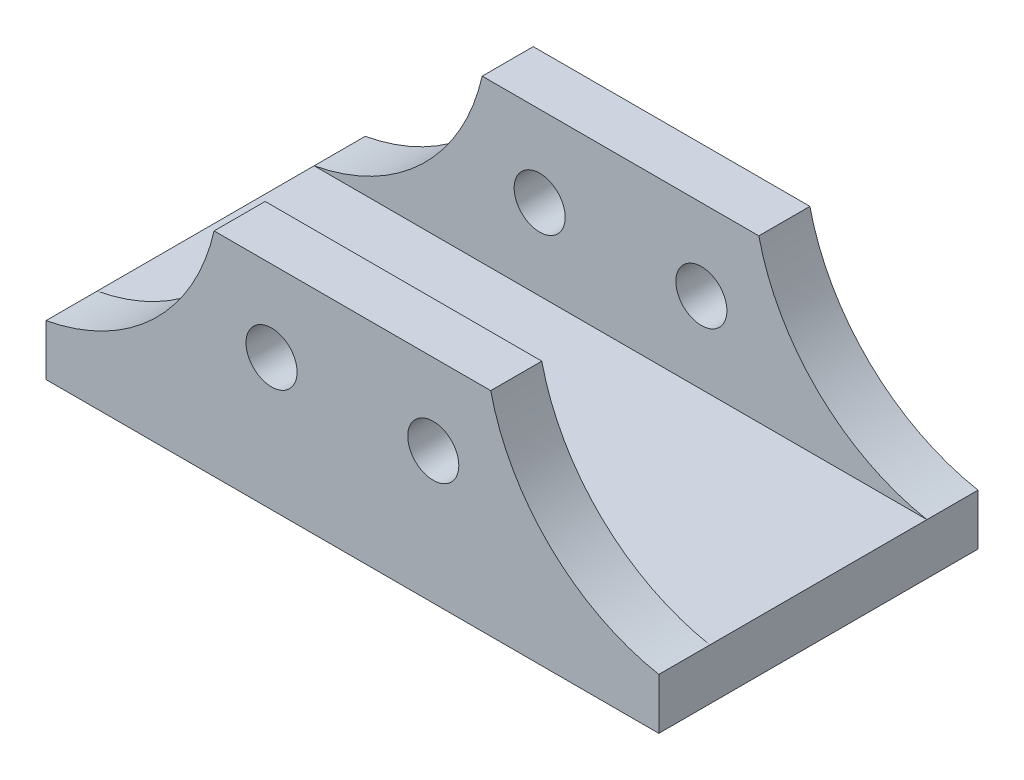
ISO-10303-21;
HEADER;
FILE_DESCRIPTION(('STEP AP214'),'2;1');
FILE_NAME('part.step','',(''),(''),'','','');
FILE_SCHEMA(('AUTOMOTIVE_DESIGN { 1 0 10303 214 1 1 1 1 }'));
ENDSEC;
DATA;
#1=APPLICATION_CONTEXT('core data for automotive mechanical design processes');
#2=APPLICATION_PROTOCOL_DEFINITION('international standard','automotive_design',2000,#1);
#3=PRODUCT_CONTEXT('',#1,'mechanical');
#4=PRODUCT('Part','Part','',(#3));
#5=PRODUCT_RELATED_PRODUCT_CATEGORY('part','',(#4));
#6=PRODUCT_DEFINITION_FORMATION('','',#4);
#7=PRODUCT_DEFINITION_CONTEXT('part definition',#1,'design');
#8=PRODUCT_DEFINITION('design','',#6,#7);
#9=PRODUCT_DEFINITION_SHAPE('','',#8);
#10=(LENGTH_UNIT() NAMED_UNIT(*) SI_UNIT(.MILLI.,.METRE.));
#11=(NAMED_UNIT(*) PLANE_ANGLE_UNIT() SI_UNIT($,.RADIAN.));
#12=(NAMED_UNIT(*) SI_UNIT($,.STERADIAN.) SOLID_ANGLE_UNIT());
#13=UNCERTAINTY_MEASURE_WITH_UNIT(LENGTH_MEASURE(1.E-05),#10,'distance_accuracy_value','');
#14=(GEOMETRIC_REPRESENTATION_CONTEXT(3) GLOBAL_UNCERTAINTY_ASSIGNED_CONTEXT((#13)) GLOBAL_UNIT_ASSIGNED_CONTEXT((#10,
#11,#12)) REPRESENTATION_CONTEXT('',''));
#15=CARTESIAN_POINT('',(0.,0.,0.));
#16=DIRECTION('',(0.,0.,1.));
#17=DIRECTION('',(1.,0.,0.));
#18=AXIS2_PLACEMENT_3D('',#15,#16,#17);
#19=CARTESIAN_POINT('',(81.2436376247931,61.1381233205086,12.));
#20=DIRECTION('',(0.,0.,1.));
#21=DIRECTION('',(1.,0.,0.));
#22=AXIS2_PLACEMENT_3D('',#19,#20,#21);
#23=PLANE('',#22);
#24=DIRECTION('',(-1.,0.,0.));
#25=VECTOR('',#24,1.);
#26=CARTESIAN_POINT('',(-72.,12.,12.));
#27=LINE('',#26,#25);
#28=CARTESIAN_POINT('',(72.,12.,12.));
#29=VERTEX_POINT('',#28);
#30=CARTESIAN_POINT('',(-72.,12.,12.));
#31=VERTEX_POINT('',#30);
#32=EDGE_CURVE('E209',#29,#31,#27,.T.);
#33=ORIENTED_EDGE('',*,*,#32,.F.);
#34=CARTESIAN_POINT('',(81.2436376247931,61.1381233205086,12.));
#35=DIRECTION('',(0.,0.,1.));
#36=DIRECTION('',(1.,0.,0.));
#37=AXIS2_PLACEMENT_3D('',#34,#35,#36);
#38=CIRCLE('',#37,50.);
#39=CARTESIAN_POINT('',(32.5,50.,12.));
#40=VERTEX_POINT('',#39);
#41=EDGE_CURVE('E231',#40,#29,#38,.T.);
#42=ORIENTED_EDGE('',*,*,#41,.F.);
#43=DIRECTION('',(1.,0.,0.));
#44=VECTOR('',#43,1.);
#45=CARTESIAN_POINT('',(-32.5,50.,12.));
#46=LINE('',#45,#44);
#47=CARTESIAN_POINT('',(-32.5,50.,12.));
#48=VERTEX_POINT('',#47);
#49=EDGE_CURVE('E229',#48,#40,#46,.T.);
#50=ORIENTED_EDGE('',*,*,#49,.F.);
#51=CARTESIAN_POINT('',(-81.2436376247931,61.1381233205086,12.));
#52=DIRECTION('',(0.,0.,-1.));
#53=DIRECTION('',(-1.,0.,0.));
#54=AXIS2_PLACEMENT_3D('',#51,#52,#53);
#55=CIRCLE('',#54,50.);
#56=EDGE_CURVE('E233',#48,#31,#55,.T.);
#57=ORIENTED_EDGE('',*,*,#56,.T.);
#58=EDGE_LOOP('',(#33,#42,#50,#57));
#59=FACE_BOUND('',#58,.T.);
#60=CARTESIAN_POINT('',(-19.,31.,12.));
#61=DIRECTION('',(0.,0.,-1.));
#62=DIRECTION('',(-1.,0.,0.));
#63=AXIS2_PLACEMENT_3D('',#60,#61,#62);
#64=CIRCLE('',#63,6.);
#65=CARTESIAN_POINT('',(-25.,31.,12.));
#66=VERTEX_POINT('',#65);
#67=EDGE_CURVE('E217',#66,#66,#64,.T.);
#68=ORIENTED_EDGE('',*,*,#67,.T.);
#69=EDGE_LOOP('',(#68));
#70=FACE_BOUND('',#69,.T.);
#71=CARTESIAN_POINT('',(19.,31.,12.));
#72=DIRECTION('',(0.,0.,1.));
#73=DIRECTION('',(1.,0.,0.));
#74=AXIS2_PLACEMENT_3D('',#71,#72,#73);
#75=CIRCLE('',#74,6.);
#76=CARTESIAN_POINT('',(25.,31.,12.));
#77=VERTEX_POINT('',#76);
#78=EDGE_CURVE('E223',#77,#77,#75,.T.);
#79=ORIENTED_EDGE('',*,*,#78,.F.);
#80=EDGE_LOOP('',(#79));
#81=FACE_BOUND('',#80,.T.);
#82=ADVANCED_FACE('F74',(#59,#70,#81),#23,.T.);
#83=CARTESIAN_POINT('',(81.2436376247931,61.1381233205086,0.));
#84=DIRECTION('',(0.,0.,1.));
#85=DIRECTION('',(1.,0.,0.));
#86=AXIS2_PLACEMENT_3D('',#83,#84,#85);
#87=PLANE('',#86);
#88=CARTESIAN_POINT('',(-19.,31.,0.));
#89=DIRECTION('',(0.,0.,-1.));
#90=DIRECTION('',(-1.,0.,0.));
#91=AXIS2_PLACEMENT_3D('',#88,#89,#90);
#92=CIRCLE('',#91,6.);
#93=CARTESIAN_POINT('',(-25.,31.,0.));
#94=VERTEX_POINT('',#93);
#95=EDGE_CURVE('E215',#94,#94,#92,.T.);
#96=ORIENTED_EDGE('',*,*,#95,.F.);
#97=EDGE_LOOP('',(#96));
#98=FACE_BOUND('',#97,.T.);
#99=DIRECTION('',(1.,0.,0.));
#100=VECTOR('',#99,1.);
#101=CARTESIAN_POINT('',(-32.5,50.,0.));
#102=LINE('',#101,#100);
#103=CARTESIAN_POINT('',(-32.5,50.,0.));
#104=VERTEX_POINT('',#103);
#105=CARTESIAN_POINT('',(32.5,50.,0.));
#106=VERTEX_POINT('',#105);
#107=EDGE_CURVE('E226',#104,#106,#102,.T.);
#108=ORIENTED_EDGE('',*,*,#107,.T.);
#109=CARTESIAN_POINT('',(81.2436376247931,61.1381233205086,0.));
#110=DIRECTION('',(0.,0.,1.));
#111=DIRECTION('',(1.,0.,0.));
#112=AXIS2_PLACEMENT_3D('',#109,#110,#111);
#113=CIRCLE('',#112,50.);
#114=CARTESIAN_POINT('',(72.,12.,0.));
#115=VERTEX_POINT('',#114);
#116=EDGE_CURVE('E238',#106,#115,#113,.T.);
#117=ORIENTED_EDGE('',*,*,#116,.T.);
#118=DIRECTION('',(0.,-1.,0.));
#119=VECTOR('',#118,1.);
#120=CARTESIAN_POINT('',(72.,12.,0.));
#121=LINE('',#120,#119);
#122=CARTESIAN_POINT('',(72.,0.,0.));
#123=VERTEX_POINT('',#122);
#124=EDGE_CURVE('E241',#115,#123,#121,.T.);
#125=ORIENTED_EDGE('',*,*,#124,.T.);
#126=DIRECTION('',(1.,0.,0.));
#127=VECTOR('',#126,1.);
#128=CARTESIAN_POINT('',(-72.,0.,0.));
#129=LINE('',#128,#127);
#130=CARTESIAN_POINT('',(-72.,0.,0.));
#131=VERTEX_POINT('',#130);
#132=EDGE_CURVE('E244',#131,#123,#129,.T.);
#133=ORIENTED_EDGE('',*,*,#132,.F.);
#134=DIRECTION('',(0.,-1.,0.));
#135=VECTOR('',#134,1.);
#136=CARTESIAN_POINT('',(-72.,12.,0.));
#137=LINE('',#136,#135);
#138=CARTESIAN_POINT('',(-72.,12.,0.));
#139=VERTEX_POINT('',#138);
#140=EDGE_CURVE('E247',#139,#131,#137,.T.);
#141=ORIENTED_EDGE('',*,*,#140,.F.);
#142=CARTESIAN_POINT('',(-81.2436376247931,61.1381233205086,0.));
#143=DIRECTION('',(0.,0.,-1.));
#144=DIRECTION('',(-1.,0.,0.));
#145=AXIS2_PLACEMENT_3D('',#142,#143,#144);
#146=CIRCLE('',#145,50.);
#147=EDGE_CURVE('E115',#104,#139,#146,.T.);
#148=ORIENTED_EDGE('',*,*,#147,.F.);
#149=EDGE_LOOP('',(#108,#117,#125,#133,#141,#148));
#150=FACE_BOUND('',#149,.T.);
#151=CARTESIAN_POINT('',(19.,31.,0.));
#152=DIRECTION('',(0.,0.,1.));
#153=DIRECTION('',(1.,0.,0.));
#154=AXIS2_PLACEMENT_3D('',#151,#152,#153);
#155=CIRCLE('',#154,6.);
#156=CARTESIAN_POINT('',(25.,31.,0.));
#157=VERTEX_POINT('',#156);
#158=EDGE_CURVE('E220',#157,#157,#155,.T.);
#159=ORIENTED_EDGE('',*,*,#158,.T.);
#160=EDGE_LOOP('',(#159));
#161=FACE_BOUND('',#160,.T.);
#162=ADVANCED_FACE('F261',(#98,#150,#161),#87,.F.);
#163=CARTESIAN_POINT('',(-32.5,50.,12.));
#164=DIRECTION('',(0.,1.,0.));
#165=DIRECTION('',(0.,0.,1.));
#166=AXIS2_PLACEMENT_3D('',#163,#164,#165);
#167=PLANE('',#166);
#168=ORIENTED_EDGE('',*,*,#107,.F.);
#169=DIRECTION('',(0.,0.,-1.));
#170=VECTOR('',#169,1.);
#171=CARTESIAN_POINT('',(-32.5,50.,12.));
#172=LINE('',#171,#170);
#173=EDGE_CURVE('E12',#48,#104,#172,.T.);
#174=ORIENTED_EDGE('',*,*,#173,.F.);
#175=ORIENTED_EDGE('',*,*,#49,.T.);
#176=DIRECTION('',(0.,0.,-1.));
#177=VECTOR('',#176,1.);
#178=CARTESIAN_POINT('',(32.5,50.,12.));
#179=LINE('',#178,#177);
#180=EDGE_CURVE('E78',#40,#106,#179,.T.);
#181=ORIENTED_EDGE('',*,*,#180,.T.);
#182=EDGE_LOOP('',(#168,#174,#175,#181));
#183=FACE_BOUND('',#182,.T.);
#184=ADVANCED_FACE('F76',(#183),#167,.T.);
#185=CARTESIAN_POINT('',(-81.2436376247931,61.1381233205086,12.));
#186=DIRECTION('',(0.,0.,-1.));
#187=DIRECTION('',(-1.,0.,0.));
#188=AXIS2_PLACEMENT_3D('',#185,#186,#187);
#189=CYLINDRICAL_SURFACE('',#188,50.);
#190=ORIENTED_EDGE('',*,*,#147,.T.);
#191=DIRECTION('',(0.,0.,-1.));
#192=VECTOR('',#191,1.);
#193=CARTESIAN_POINT('',(-72.,12.,12.));
#194=LINE('',#193,#192);
#195=EDGE_CURVE('E84',#31,#139,#194,.T.);
#196=ORIENTED_EDGE('',*,*,#195,.F.);
#197=ORIENTED_EDGE('',*,*,#56,.F.);
#198=ORIENTED_EDGE('',*,*,#173,.T.);
#199=EDGE_LOOP('',(#190,#196,#197,#198));
#200=FACE_BOUND('',#199,.T.);
#201=ADVANCED_FACE('F288',(#200),#189,.F.);
#202=CARTESIAN_POINT('',(-72.,12.,12.));
#203=DIRECTION('',(1.,0.,0.));
#204=DIRECTION('',(0.,0.,-1.));
#205=AXIS2_PLACEMENT_3D('',#202,#203,#204);
#206=PLANE('',#205);
#207=ORIENTED_EDGE('',*,*,#140,.T.);
#208=DIRECTION('',(0.,0.,-1.));
#209=VECTOR('',#208,1.);
#210=CARTESIAN_POINT('',(-72.,0.,12.));
#211=LINE('',#210,#209);
#212=CARTESIAN_POINT('',(-72.,0.,75.));
#213=VERTEX_POINT('',#212);
#214=EDGE_CURVE('E251',#213,#131,#211,.T.);
#215=ORIENTED_EDGE('',*,*,#214,.F.);
#216=DIRECTION('',(0.,-1.,0.));
#217=VECTOR('',#216,1.);
#218=CARTESIAN_POINT('',(-72.,12.,75.));
#219=LINE('',#218,#217);
#220=CARTESIAN_POINT('',(-72.,12.,75.));
#221=VERTEX_POINT('',#220);
#222=EDGE_CURVE('E183',#221,#213,#219,.T.);
#223=ORIENTED_EDGE('',*,*,#222,.F.);
#224=DIRECTION('',(0.,0.,1.));
#225=VECTOR('',#224,1.);
#226=CARTESIAN_POINT('',(-72.,12.,63.));
#227=LINE('',#226,#225);
#228=CARTESIAN_POINT('',(-72.,12.,63.));
#229=VERTEX_POINT('',#228);
#230=EDGE_CURVE('E205',#229,#221,#227,.T.);
#231=ORIENTED_EDGE('',*,*,#230,.F.);
#232=DIRECTION('',(0.,0.,1.));
#233=VECTOR('',#232,1.);
#234=CARTESIAN_POINT('',(-72.,12.,12.));
#235=LINE('',#234,#233);
#236=EDGE_CURVE('E213',#31,#229,#235,.T.);
#237=ORIENTED_EDGE('',*,*,#236,.F.);
#238=ORIENTED_EDGE('',*,*,#195,.T.);
#239=EDGE_LOOP('',(#207,#215,#223,#231,#237,#238));
#240=FACE_BOUND('',#239,.T.);
#241=ADVANCED_FACE('F266',(#240),#206,.F.);
#242=CARTESIAN_POINT('',(-72.,0.,12.));
#243=DIRECTION('',(0.,1.,0.));
#244=DIRECTION('',(0.,0.,1.));
#245=AXIS2_PLACEMENT_3D('',#242,#243,#244);
#246=PLANE('',#245);
#247=ORIENTED_EDGE('',*,*,#132,.T.);
#248=DIRECTION('',(0.,0.,-1.));
#249=VECTOR('',#248,1.);
#250=CARTESIAN_POINT('',(72.,0.,12.));
#251=LINE('',#250,#249);
#252=CARTESIAN_POINT('',(72.,0.,75.));
#253=VERTEX_POINT('',#252);
#254=EDGE_CURVE('E254',#253,#123,#251,.T.);
#255=ORIENTED_EDGE('',*,*,#254,.F.);
#256=DIRECTION('',(1.,0.,0.));
#257=VECTOR('',#256,1.);
#258=CARTESIAN_POINT('',(-72.,0.,75.));
#259=LINE('',#258,#257);
#260=EDGE_CURVE('E197',#213,#253,#259,.T.);
#261=ORIENTED_EDGE('',*,*,#260,.F.);
#262=ORIENTED_EDGE('',*,*,#214,.T.);
#263=EDGE_LOOP('',(#247,#255,#261,#262));
#264=FACE_BOUND('',#263,.T.);
#265=ADVANCED_FACE('F271',(#264),#246,.F.);
#266=CARTESIAN_POINT('',(72.,12.,12.));
#267=DIRECTION('',(1.,0.,0.));
#268=DIRECTION('',(0.,0.,-1.));
#269=AXIS2_PLACEMENT_3D('',#266,#267,#268);
#270=PLANE('',#269);
#271=ORIENTED_EDGE('',*,*,#124,.F.);
#272=DIRECTION('',(0.,0.,-1.));
#273=VECTOR('',#272,1.);
#274=CARTESIAN_POINT('',(72.,12.,12.));
#275=LINE('',#274,#273);
#276=EDGE_CURVE('E255',#29,#115,#275,.T.);
#277=ORIENTED_EDGE('',*,*,#276,.F.);
#278=DIRECTION('',(0.,0.,1.));
#279=VECTOR('',#278,1.);
#280=CARTESIAN_POINT('',(72.,12.,12.));
#281=LINE('',#280,#279);
#282=CARTESIAN_POINT('',(72.,12.,63.));
#283=VERTEX_POINT('',#282);
#284=EDGE_CURVE('E212',#29,#283,#281,.T.);
#285=ORIENTED_EDGE('',*,*,#284,.T.);
#286=DIRECTION('',(0.,0.,1.));
#287=VECTOR('',#286,1.);
#288=CARTESIAN_POINT('',(72.,12.,63.));
#289=LINE('',#288,#287);
#290=CARTESIAN_POINT('',(72.,12.,75.));
#291=VERTEX_POINT('',#290);
#292=EDGE_CURVE('E166',#283,#291,#289,.T.);
#293=ORIENTED_EDGE('',*,*,#292,.T.);
#294=DIRECTION('',(0.,-1.,0.));
#295=VECTOR('',#294,1.);
#296=CARTESIAN_POINT('',(72.,12.,75.));
#297=LINE('',#296,#295);
#298=EDGE_CURVE('E194',#291,#253,#297,.T.);
#299=ORIENTED_EDGE('',*,*,#298,.T.);
#300=ORIENTED_EDGE('',*,*,#254,.T.);
#301=EDGE_LOOP('',(#271,#277,#285,#293,#299,#300));
#302=FACE_BOUND('',#301,.T.);
#303=ADVANCED_FACE('F281',(#302),#270,.T.);
#304=CARTESIAN_POINT('',(81.2436376247931,61.1381233205086,12.));
#305=DIRECTION('',(0.,0.,-1.));
#306=DIRECTION('',(-1.,0.,0.));
#307=AXIS2_PLACEMENT_3D('',#304,#305,#306);
#308=CYLINDRICAL_SURFACE('',#307,50.);
#309=ORIENTED_EDGE('',*,*,#116,.F.);
#310=ORIENTED_EDGE('',*,*,#180,.F.);
#311=ORIENTED_EDGE('',*,*,#41,.T.);
#312=ORIENTED_EDGE('',*,*,#276,.T.);
#313=EDGE_LOOP('',(#309,#310,#311,#312));
#314=FACE_BOUND('',#313,.T.);
#315=ADVANCED_FACE('F259',(#314),#308,.F.);
#316=CARTESIAN_POINT('',(19.,31.,12.));
#317=DIRECTION('',(0.,0.,-1.));
#318=DIRECTION('',(-1.,0.,0.));
#319=AXIS2_PLACEMENT_3D('',#316,#317,#318);
#320=CYLINDRICAL_SURFACE('',#319,6.);
#321=ORIENTED_EDGE('',*,*,#78,.T.);
#322=EDGE_LOOP('',(#321));
#323=FACE_BOUND('',#322,.T.);
#324=ORIENTED_EDGE('',*,*,#158,.F.);
#325=EDGE_LOOP('',(#324));
#326=FACE_BOUND('',#325,.T.);
#327=ADVANCED_FACE('F304',(#323,#326),#320,.F.);
#328=CARTESIAN_POINT('',(-19.,31.,12.));
#329=DIRECTION('',(0.,0.,-1.));
#330=DIRECTION('',(-1.,0.,0.));
#331=AXIS2_PLACEMENT_3D('',#328,#329,#330);
#332=CYLINDRICAL_SURFACE('',#331,6.);
#333=ORIENTED_EDGE('',*,*,#67,.F.);
#334=EDGE_LOOP('',(#333));
#335=FACE_BOUND('',#334,.T.);
#336=ORIENTED_EDGE('',*,*,#95,.T.);
#337=EDGE_LOOP('',(#336));
#338=FACE_BOUND('',#337,.T.);
#339=ADVANCED_FACE('F307',(#335,#338),#332,.F.);
#340=CARTESIAN_POINT('',(-72.,12.,12.));
#341=DIRECTION('',(0.,1.,0.));
#342=DIRECTION('',(0.,0.,1.));
#343=AXIS2_PLACEMENT_3D('',#340,#341,#342);
#344=PLANE('',#343);
#345=ORIENTED_EDGE('',*,*,#236,.T.);
#346=DIRECTION('',(-1.,0.,0.));
#347=VECTOR('',#346,1.);
#348=CARTESIAN_POINT('',(-72.,12.,63.));
#349=LINE('',#348,#347);
#350=EDGE_CURVE('E204',#283,#229,#349,.T.);
#351=ORIENTED_EDGE('',*,*,#350,.F.);
#352=ORIENTED_EDGE('',*,*,#284,.F.);
#353=ORIENTED_EDGE('',*,*,#32,.T.);
#354=EDGE_LOOP('',(#345,#351,#352,#353));
#355=FACE_BOUND('',#354,.T.);
#356=ADVANCED_FACE('F285',(#355),#344,.T.);
#357=CARTESIAN_POINT('',(81.2436376247931,61.1381233205086,63.));
#358=DIRECTION('',(0.,0.,-1.));
#359=DIRECTION('',(1.,0.,0.));
#360=AXIS2_PLACEMENT_3D('',#357,#358,#359);
#361=PLANE('',#360);
#362=CARTESIAN_POINT('',(-19.,31.,63.));
#363=DIRECTION('',(0.,0.,-1.));
#364=DIRECTION('',(-1.,0.,0.));
#365=AXIS2_PLACEMENT_3D('',#362,#363,#364);
#366=CIRCLE('',#365,6.);
#367=CARTESIAN_POINT('',(-25.,31.,63.));
#368=VERTEX_POINT('',#367);
#369=EDGE_CURVE('E338',#368,#368,#366,.T.);
#370=ORIENTED_EDGE('',*,*,#369,.F.);
#371=EDGE_LOOP('',(#370));
#372=FACE_BOUND('',#371,.T.);
#373=CARTESIAN_POINT('',(81.2436376247931,61.1381233205086,63.));
#374=DIRECTION('',(0.,0.,1.));
#375=DIRECTION('',(1.,0.,0.));
#376=AXIS2_PLACEMENT_3D('',#373,#374,#375);
#377=CIRCLE('',#376,50.);
#378=CARTESIAN_POINT('',(32.5,50.,63.));
#379=VERTEX_POINT('',#378);
#380=EDGE_CURVE('E171',#379,#283,#377,.T.);
#381=ORIENTED_EDGE('',*,*,#380,.T.);
#382=ORIENTED_EDGE('',*,*,#350,.T.);
#383=CARTESIAN_POINT('',(-81.2436376247931,61.1381233205086,63.));
#384=DIRECTION('',(0.,0.,-1.));
#385=DIRECTION('',(-1.,0.,0.));
#386=AXIS2_PLACEMENT_3D('',#383,#384,#385);
#387=CIRCLE('',#386,50.);
#388=CARTESIAN_POINT('',(-32.5,50.,63.));
#389=VERTEX_POINT('',#388);
#390=EDGE_CURVE('E167',#389,#229,#387,.T.);
#391=ORIENTED_EDGE('',*,*,#390,.F.);
#392=DIRECTION('',(1.,0.,0.));
#393=VECTOR('',#392,1.);
#394=CARTESIAN_POINT('',(-32.5,50.,63.));
#395=LINE('',#394,#393);
#396=EDGE_CURVE('E160',#389,#379,#395,.T.);
#397=ORIENTED_EDGE('',*,*,#396,.T.);
#398=EDGE_LOOP('',(#381,#382,#391,#397));
#399=FACE_BOUND('',#398,.T.);
#400=CARTESIAN_POINT('',(19.,31.,63.));
#401=DIRECTION('',(0.,0.,1.));
#402=DIRECTION('',(1.,0.,0.));
#403=AXIS2_PLACEMENT_3D('',#400,#401,#402);
#404=CIRCLE('',#403,6.);
#405=CARTESIAN_POINT('',(25.,31.,63.));
#406=VERTEX_POINT('',#405);
#407=EDGE_CURVE('E192',#406,#406,#404,.T.);
#408=ORIENTED_EDGE('',*,*,#407,.T.);
#409=EDGE_LOOP('',(#408));
#410=FACE_BOUND('',#409,.T.);
#411=ADVANCED_FACE('F177',(#372,#399,#410),#361,.T.);
#412=CARTESIAN_POINT('',(81.2436376247931,61.1381233205086,75.));
#413=DIRECTION('',(0.,0.,-1.));
#414=DIRECTION('',(1.,0.,0.));
#415=AXIS2_PLACEMENT_3D('',#412,#413,#414);
#416=PLANE('',#415);
#417=CARTESIAN_POINT('',(-19.,31.,75.));
#418=DIRECTION('',(0.,0.,-1.));
#419=DIRECTION('',(-1.,0.,0.));
#420=AXIS2_PLACEMENT_3D('',#417,#418,#419);
#421=CIRCLE('',#420,6.);
#422=CARTESIAN_POINT('',(-25.,31.,75.));
#423=VERTEX_POINT('',#422);
#424=EDGE_CURVE('E341',#423,#423,#421,.T.);
#425=ORIENTED_EDGE('',*,*,#424,.T.);
#426=EDGE_LOOP('',(#425));
#427=FACE_BOUND('',#426,.T.);
#428=DIRECTION('',(1.,0.,0.));
#429=VECTOR('',#428,1.);
#430=CARTESIAN_POINT('',(-32.5,50.,75.));
#431=LINE('',#430,#429);
#432=CARTESIAN_POINT('',(-32.5,50.,75.));
#433=VERTEX_POINT('',#432);
#434=CARTESIAN_POINT('',(32.5,50.,75.));
#435=VERTEX_POINT('',#434);
#436=EDGE_CURVE('E162',#433,#435,#431,.T.);
#437=ORIENTED_EDGE('',*,*,#436,.F.);
#438=CARTESIAN_POINT('',(-81.2436376247931,61.1381233205086,75.));
#439=DIRECTION('',(0.,0.,-1.));
#440=DIRECTION('',(-1.,0.,0.));
#441=AXIS2_PLACEMENT_3D('',#438,#439,#440);
#442=CIRCLE('',#441,50.);
#443=EDGE_CURVE('E180',#433,#221,#442,.T.);
#444=ORIENTED_EDGE('',*,*,#443,.T.);
#445=ORIENTED_EDGE('',*,*,#222,.T.);
#446=ORIENTED_EDGE('',*,*,#260,.T.);
#447=ORIENTED_EDGE('',*,*,#298,.F.);
#448=CARTESIAN_POINT('',(81.2436376247931,61.1381233205086,75.));
#449=DIRECTION('',(0.,0.,1.));
#450=DIRECTION('',(1.,0.,0.));
#451=AXIS2_PLACEMENT_3D('',#448,#449,#450);
#452=CIRCLE('',#451,50.);
#453=EDGE_CURVE('E191',#435,#291,#452,.T.);
#454=ORIENTED_EDGE('',*,*,#453,.F.);
#455=EDGE_LOOP('',(#437,#444,#445,#446,#447,#454));
#456=FACE_BOUND('',#455,.T.);
#457=CARTESIAN_POINT('',(19.,31.,75.));
#458=DIRECTION('',(0.,0.,1.));
#459=DIRECTION('',(1.,0.,0.));
#460=AXIS2_PLACEMENT_3D('',#457,#458,#459);
#461=CIRCLE('',#460,6.);
#462=CARTESIAN_POINT('',(25.,31.,75.));
#463=VERTEX_POINT('',#462);
#464=EDGE_CURVE('E186',#463,#463,#461,.T.);
#465=ORIENTED_EDGE('',*,*,#464,.F.);
#466=EDGE_LOOP('',(#465));
#467=FACE_BOUND('',#466,.T.);
#468=ADVANCED_FACE('F274',(#427,#456,#467),#416,.F.);
#469=CARTESIAN_POINT('',(-32.5,50.,63.));
#470=DIRECTION('',(0.,1.,0.));
#471=DIRECTION('',(0.,0.,-1.));
#472=AXIS2_PLACEMENT_3D('',#469,#470,#471);
#473=PLANE('',#472);
#474=ORIENTED_EDGE('',*,*,#436,.T.);
#475=DIRECTION('',(0.,0.,1.));
#476=VECTOR('',#475,1.);
#477=CARTESIAN_POINT('',(32.5,50.,63.));
#478=LINE('',#477,#476);
#479=EDGE_CURVE('E156',#379,#435,#478,.T.);
#480=ORIENTED_EDGE('',*,*,#479,.F.);
#481=ORIENTED_EDGE('',*,*,#396,.F.);
#482=DIRECTION('',(0.,0.,1.));
#483=VECTOR('',#482,1.);
#484=CARTESIAN_POINT('',(-32.5,50.,63.));
#485=LINE('',#484,#483);
#486=EDGE_CURVE('E202',#389,#433,#485,.T.);
#487=ORIENTED_EDGE('',*,*,#486,.T.);
#488=EDGE_LOOP('',(#474,#480,#481,#487));
#489=FACE_BOUND('',#488,.T.);
#490=ADVANCED_FACE('F158',(#489),#473,.T.);
#491=CARTESIAN_POINT('',(-81.2436376247931,61.1381233205086,63.));
#492=DIRECTION('',(0.,0.,1.));
#493=DIRECTION('',(-1.,0.,0.));
#494=AXIS2_PLACEMENT_3D('',#491,#492,#493);
#495=CYLINDRICAL_SURFACE('',#494,50.);
#496=ORIENTED_EDGE('',*,*,#443,.F.);
#497=ORIENTED_EDGE('',*,*,#486,.F.);
#498=ORIENTED_EDGE('',*,*,#390,.T.);
#499=ORIENTED_EDGE('',*,*,#230,.T.);
#500=EDGE_LOOP('',(#496,#497,#498,#499));
#501=FACE_BOUND('',#500,.T.);
#502=ADVANCED_FACE('F279',(#501),#495,.F.);
#503=CARTESIAN_POINT('',(81.2436376247931,61.1381233205086,63.));
#504=DIRECTION('',(0.,0.,1.));
#505=DIRECTION('',(-1.,0.,0.));
#506=AXIS2_PLACEMENT_3D('',#503,#504,#505);
#507=CYLINDRICAL_SURFACE('',#506,50.);
#508=ORIENTED_EDGE('',*,*,#453,.T.);
#509=ORIENTED_EDGE('',*,*,#292,.F.);
#510=ORIENTED_EDGE('',*,*,#380,.F.);
#511=ORIENTED_EDGE('',*,*,#479,.T.);
#512=EDGE_LOOP('',(#508,#509,#510,#511));
#513=FACE_BOUND('',#512,.T.);
#514=ADVANCED_FACE('F172',(#513),#507,.F.);
#515=CARTESIAN_POINT('',(19.,31.,63.));
#516=DIRECTION('',(0.,0.,1.));
#517=DIRECTION('',(-1.,0.,0.));
#518=AXIS2_PLACEMENT_3D('',#515,#516,#517);
#519=CYLINDRICAL_SURFACE('',#518,6.);
#520=ORIENTED_EDGE('',*,*,#407,.F.);
#521=EDGE_LOOP('',(#520));
#522=FACE_BOUND('',#521,.T.);
#523=ORIENTED_EDGE('',*,*,#464,.T.);
#524=EDGE_LOOP('',(#523));
#525=FACE_BOUND('',#524,.T.);
#526=ADVANCED_FACE('F318',(#522,#525),#519,.F.);
#527=CARTESIAN_POINT('',(-19.,31.,63.));
#528=DIRECTION('',(0.,0.,1.));
#529=DIRECTION('',(-1.,0.,0.));
#530=AXIS2_PLACEMENT_3D('',#527,#528,#529);
#531=CYLINDRICAL_SURFACE('',#530,6.);
#532=ORIENTED_EDGE('',*,*,#369,.T.);
#533=EDGE_LOOP('',(#532));
#534=FACE_BOUND('',#533,.T.);
#535=ORIENTED_EDGE('',*,*,#424,.F.);
#536=EDGE_LOOP('',(#535));
#537=FACE_BOUND('',#536,.T.);
#538=ADVANCED_FACE('F329',(#534,#537),#531,.F.);
#539=CLOSED_SHELL('',(#82,#162,#184,#201,#241,#265,#303,#315,#327,#339,#356,#411,#468,#490,#502,
#514,#526,#538));
#540=MANIFOLD_SOLID_BREP('B2',#539);
#541=ADVANCED_BREP_SHAPE_REPRESENTATION('',(#18,#540),#14);
#542=SHAPE_DEFINITION_REPRESENTATION(#9,#541);
ENDSEC;
END-ISO-10303-21;
